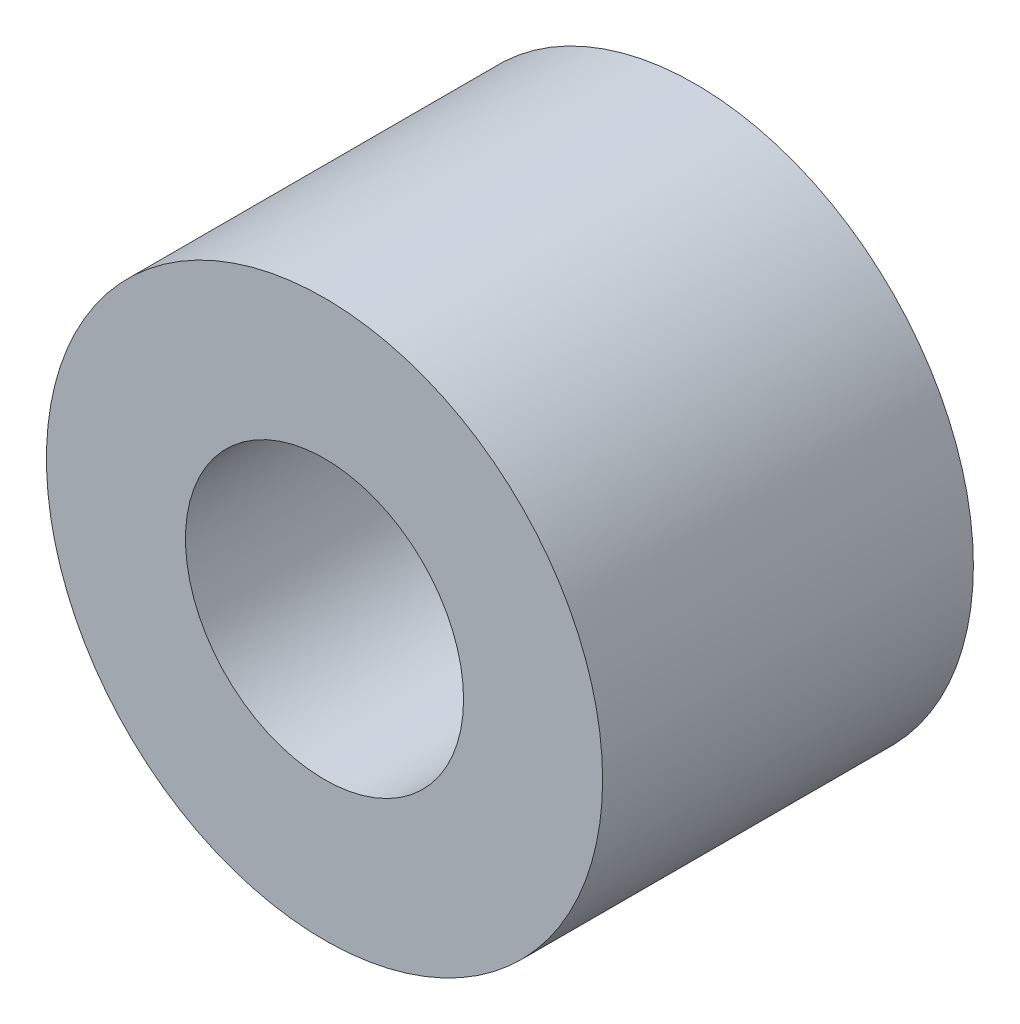
ISO-10303-21;
HEADER;
FILE_DESCRIPTION(('STEP AP214'),'2;1');
FILE_NAME('part.step','',(''),(''),'','','');
FILE_SCHEMA(('AUTOMOTIVE_DESIGN { 1 0 10303 214 1 1 1 1 }'));
ENDSEC;
DATA;
#1=APPLICATION_CONTEXT('core data for automotive mechanical design processes');
#2=APPLICATION_PROTOCOL_DEFINITION('international standard','automotive_design',2000,#1);
#3=PRODUCT_CONTEXT('',#1,'mechanical');
#4=PRODUCT('Part','Part','',(#3));
#5=PRODUCT_RELATED_PRODUCT_CATEGORY('part','',(#4));
#6=PRODUCT_DEFINITION_FORMATION('','',#4);
#7=PRODUCT_DEFINITION_CONTEXT('part definition',#1,'design');
#8=PRODUCT_DEFINITION('design','',#6,#7);
#9=PRODUCT_DEFINITION_SHAPE('','',#8);
#10=(LENGTH_UNIT() NAMED_UNIT(*) SI_UNIT(.MILLI.,.METRE.));
#11=(NAMED_UNIT(*) PLANE_ANGLE_UNIT() SI_UNIT($,.RADIAN.));
#12=(NAMED_UNIT(*) SI_UNIT($,.STERADIAN.) SOLID_ANGLE_UNIT());
#13=UNCERTAINTY_MEASURE_WITH_UNIT(LENGTH_MEASURE(1.E-05),#10,'distance_accuracy_value','');
#14=(GEOMETRIC_REPRESENTATION_CONTEXT(3) GLOBAL_UNCERTAINTY_ASSIGNED_CONTEXT((#13)) GLOBAL_UNIT_ASSIGNED_CONTEXT((#10,
#11,#12)) REPRESENTATION_CONTEXT('',''));
#15=CARTESIAN_POINT('',(0.,0.,0.));
#16=DIRECTION('',(0.,0.,1.));
#17=DIRECTION('',(1.,0.,0.));
#18=AXIS2_PLACEMENT_3D('',#15,#16,#17);
#19=CARTESIAN_POINT('',(0.,0.,12.7));
#20=DIRECTION('',(0.,0.,1.));
#21=DIRECTION('',(1.,0.,0.));
#22=AXIS2_PLACEMENT_3D('',#19,#20,#21);
#23=PLANE('',#22);
#24=CARTESIAN_POINT('',(0.,0.,12.7));
#25=DIRECTION('',(0.,0.,1.));
#26=DIRECTION('',(1.,0.,0.));
#27=AXIS2_PLACEMENT_3D('',#24,#25,#26);
#28=CIRCLE('',#27,19.05);
#29=CARTESIAN_POINT('',(19.05,0.,12.7));
#30=VERTEX_POINT('',#29);
#31=EDGE_CURVE('E10',#30,#30,#28,.T.);
#32=ORIENTED_EDGE('',*,*,#31,.T.);
#33=EDGE_LOOP('',(#32));
#34=FACE_BOUND('',#33,.T.);
#35=CARTESIAN_POINT('',(0.,0.,12.7));
#36=DIRECTION('',(0.,0.,1.));
#37=DIRECTION('',(1.,0.,0.));
#38=AXIS2_PLACEMENT_3D('',#35,#36,#37);
#39=CIRCLE('',#38,9.525);
#40=CARTESIAN_POINT('',(9.525,0.,12.7));
#41=VERTEX_POINT('',#40);
#42=EDGE_CURVE('E41',#41,#41,#39,.T.);
#43=ORIENTED_EDGE('',*,*,#42,.F.);
#44=EDGE_LOOP('',(#43));
#45=FACE_BOUND('',#44,.T.);
#46=ADVANCED_FACE('F30',(#34,#45),#23,.T.);
#47=CARTESIAN_POINT('',(0.,0.,-12.7));
#48=DIRECTION('',(0.,0.,1.));
#49=DIRECTION('',(1.,0.,0.));
#50=AXIS2_PLACEMENT_3D('',#47,#48,#49);
#51=PLANE('',#50);
#52=CARTESIAN_POINT('',(0.,0.,-12.7));
#53=DIRECTION('',(0.,0.,1.));
#54=DIRECTION('',(1.,0.,0.));
#55=AXIS2_PLACEMENT_3D('',#52,#53,#54);
#56=CIRCLE('',#55,19.05);
#57=CARTESIAN_POINT('',(19.05,0.,-12.7));
#58=VERTEX_POINT('',#57);
#59=EDGE_CURVE('E34',#58,#58,#56,.T.);
#60=ORIENTED_EDGE('',*,*,#59,.F.);
#61=EDGE_LOOP('',(#60));
#62=FACE_BOUND('',#61,.T.);
#63=CARTESIAN_POINT('',(0.,0.,-12.7));
#64=DIRECTION('',(0.,0.,1.));
#65=DIRECTION('',(1.,0.,0.));
#66=AXIS2_PLACEMENT_3D('',#63,#64,#65);
#67=CIRCLE('',#66,9.525);
#68=CARTESIAN_POINT('',(9.525,0.,-12.7));
#69=VERTEX_POINT('',#68);
#70=EDGE_CURVE('E43',#69,#69,#67,.T.);
#71=ORIENTED_EDGE('',*,*,#70,.T.);
#72=EDGE_LOOP('',(#71));
#73=FACE_BOUND('',#72,.T.);
#74=ADVANCED_FACE('F53',(#62,#73),#51,.F.);
#75=CARTESIAN_POINT('',(0.,0.,12.7));
#76=DIRECTION('',(0.,0.,-1.));
#77=DIRECTION('',(-1.,0.,0.));
#78=AXIS2_PLACEMENT_3D('',#75,#76,#77);
#79=CYLINDRICAL_SURFACE('',#78,19.05);
#80=ORIENTED_EDGE('',*,*,#31,.F.);
#81=EDGE_LOOP('',(#80));
#82=FACE_BOUND('',#81,.T.);
#83=ORIENTED_EDGE('',*,*,#59,.T.);
#84=EDGE_LOOP('',(#83));
#85=FACE_BOUND('',#84,.T.);
#86=ADVANCED_FACE('F32',(#82,#85),#79,.T.);
#87=CARTESIAN_POINT('',(0.,0.,12.7));
#88=DIRECTION('',(0.,0.,-1.));
#89=DIRECTION('',(-1.,0.,0.));
#90=AXIS2_PLACEMENT_3D('',#87,#88,#89);
#91=CYLINDRICAL_SURFACE('',#90,9.525);
#92=ORIENTED_EDGE('',*,*,#42,.T.);
#93=EDGE_LOOP('',(#92));
#94=FACE_BOUND('',#93,.T.);
#95=ORIENTED_EDGE('',*,*,#70,.F.);
#96=EDGE_LOOP('',(#95));
#97=FACE_BOUND('',#96,.T.);
#98=ADVANCED_FACE('F49',(#94,#97),#91,.F.);
#99=CLOSED_SHELL('',(#46,#74,#86,#98));
#100=MANIFOLD_SOLID_BREP('B2',#99);
#101=ADVANCED_BREP_SHAPE_REPRESENTATION('',(#18,#100),#14);
#102=SHAPE_DEFINITION_REPRESENTATION(#9,#101);
ENDSEC;
END-ISO-10303-21;
